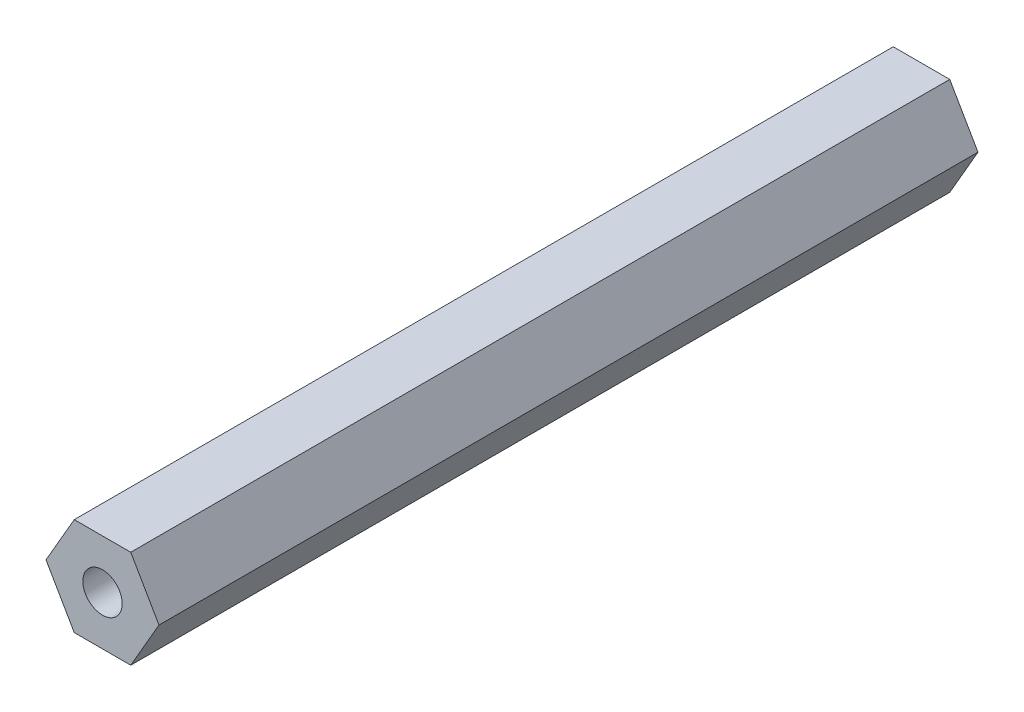
ISO-10303-21;
HEADER;
FILE_DESCRIPTION(('STEP AP214'),'2;1');
FILE_NAME('part.step','',(''),(''),'','','');
FILE_SCHEMA(('AUTOMOTIVE_DESIGN { 1 0 10303 214 1 1 1 1 }'));
ENDSEC;
DATA;
#1=APPLICATION_CONTEXT('core data for automotive mechanical design processes');
#2=APPLICATION_PROTOCOL_DEFINITION('international standard','automotive_design',2000,#1);
#3=PRODUCT_CONTEXT('',#1,'mechanical');
#4=PRODUCT('Part','Part','',(#3));
#5=PRODUCT_RELATED_PRODUCT_CATEGORY('part','',(#4));
#6=PRODUCT_DEFINITION_FORMATION('','',#4);
#7=PRODUCT_DEFINITION_CONTEXT('part definition',#1,'design');
#8=PRODUCT_DEFINITION('design','',#6,#7);
#9=PRODUCT_DEFINITION_SHAPE('','',#8);
#10=(LENGTH_UNIT() NAMED_UNIT(*) SI_UNIT(.MILLI.,.METRE.));
#11=(NAMED_UNIT(*) PLANE_ANGLE_UNIT() SI_UNIT($,.RADIAN.));
#12=(NAMED_UNIT(*) SI_UNIT($,.STERADIAN.) SOLID_ANGLE_UNIT());
#13=UNCERTAINTY_MEASURE_WITH_UNIT(LENGTH_MEASURE(1.E-05),#10,'distance_accuracy_value','');
#14=(GEOMETRIC_REPRESENTATION_CONTEXT(3) GLOBAL_UNCERTAINTY_ASSIGNED_CONTEXT((#13)) GLOBAL_UNIT_ASSIGNED_CONTEXT((#10,
#11,#12)) REPRESENTATION_CONTEXT('',''));
#15=CARTESIAN_POINT('',(0.,0.,0.));
#16=DIRECTION('',(0.,0.,1.));
#17=DIRECTION('',(1.,0.,0.));
#18=AXIS2_PLACEMENT_3D('',#15,#16,#17);
#19=CARTESIAN_POINT('',(-3.66617420935413,-6.35000000000001,106.299));
#20=DIRECTION('',(0.,1.,0.));
#21=DIRECTION('',(0.,0.,1.));
#22=AXIS2_PLACEMENT_3D('',#19,#20,#21);
#23=PLANE('',#22);
#24=DIRECTION('',(1.,0.,0.));
#25=VECTOR('',#24,1.);
#26=CARTESIAN_POINT('',(-3.66617420935413,-6.35000000000001,0.));
#27=LINE('',#26,#25);
#28=CARTESIAN_POINT('',(-3.66617420935413,-6.35000000000001,0.));
#29=VERTEX_POINT('',#28);
#30=CARTESIAN_POINT('',(3.66617420935413,-6.35000000000001,0.));
#31=VERTEX_POINT('',#30);
#32=EDGE_CURVE('E120',#29,#31,#27,.T.);
#33=ORIENTED_EDGE('',*,*,#32,.T.);
#34=DIRECTION('',(0.,0.,-1.));
#35=VECTOR('',#34,1.);
#36=CARTESIAN_POINT('',(3.66617420935413,-6.35000000000001,106.299));
#37=LINE('',#36,#35);
#38=CARTESIAN_POINT('',(3.66617420935413,-6.35000000000001,106.299));
#39=VERTEX_POINT('',#38);
#40=EDGE_CURVE('E11',#39,#31,#37,.T.);
#41=ORIENTED_EDGE('',*,*,#40,.F.);
#42=DIRECTION('',(1.,0.,0.));
#43=VECTOR('',#42,1.);
#44=CARTESIAN_POINT('',(-3.66617420935413,-6.35000000000001,106.299));
#45=LINE('',#44,#43);
#46=CARTESIAN_POINT('',(-3.66617420935413,-6.35000000000001,106.299));
#47=VERTEX_POINT('',#46);
#48=EDGE_CURVE('E131',#47,#39,#45,.T.);
#49=ORIENTED_EDGE('',*,*,#48,.F.);
#50=DIRECTION('',(0.,0.,-1.));
#51=VECTOR('',#50,1.);
#52=CARTESIAN_POINT('',(-3.66617420935413,-6.35000000000001,106.299));
#53=LINE('',#52,#51);
#54=EDGE_CURVE('E116',#47,#29,#53,.T.);
#55=ORIENTED_EDGE('',*,*,#54,.T.);
#56=EDGE_LOOP('',(#33,#41,#49,#55));
#57=FACE_BOUND('',#56,.T.);
#58=ADVANCED_FACE('F36',(#57),#23,.F.);
#59=CARTESIAN_POINT('',(3.66617420935413,-6.35000000000001,106.299));
#60=DIRECTION('',(-0.866025403784439,0.5,0.));
#61=DIRECTION('',(-0.5,-0.866025403784439,0.));
#62=AXIS2_PLACEMENT_3D('',#59,#60,#61);
#63=PLANE('',#62);
#64=DIRECTION('',(0.5,0.866025403784439,0.));
#65=VECTOR('',#64,1.);
#66=CARTESIAN_POINT('',(3.66617420935413,-6.35000000000001,0.));
#67=LINE('',#66,#65);
#68=CARTESIAN_POINT('',(7.33234841870825,0.,0.));
#69=VERTEX_POINT('',#68);
#70=EDGE_CURVE('E123',#31,#69,#67,.T.);
#71=ORIENTED_EDGE('',*,*,#70,.T.);
#72=DIRECTION('',(0.,0.,-1.));
#73=VECTOR('',#72,1.);
#74=CARTESIAN_POINT('',(7.33234841870825,0.,106.299));
#75=LINE('',#74,#73);
#76=CARTESIAN_POINT('',(7.33234841870825,0.,106.299));
#77=VERTEX_POINT('',#76);
#78=EDGE_CURVE('E44',#77,#69,#75,.T.);
#79=ORIENTED_EDGE('',*,*,#78,.F.);
#80=DIRECTION('',(0.5,0.866025403784439,0.));
#81=VECTOR('',#80,1.);
#82=CARTESIAN_POINT('',(3.66617420935413,-6.35000000000001,106.299));
#83=LINE('',#82,#81);
#84=EDGE_CURVE('E89',#39,#77,#83,.T.);
#85=ORIENTED_EDGE('',*,*,#84,.F.);
#86=ORIENTED_EDGE('',*,*,#40,.T.);
#87=EDGE_LOOP('',(#71,#79,#85,#86));
#88=FACE_BOUND('',#87,.T.);
#89=ADVANCED_FACE('F156',(#88),#63,.F.);
#90=CARTESIAN_POINT('',(7.33234841870825,0.,106.299));
#91=DIRECTION('',(-0.866025403784439,-0.5,0.));
#92=DIRECTION('',(0.5,-0.866025403784439,0.));
#93=AXIS2_PLACEMENT_3D('',#90,#91,#92);
#94=PLANE('',#93);
#95=DIRECTION('',(-0.5,0.866025403784438,0.));
#96=VECTOR('',#95,1.);
#97=CARTESIAN_POINT('',(7.33234841870825,0.,0.));
#98=LINE('',#97,#96);
#99=CARTESIAN_POINT('',(3.66617420935412,6.35000000000001,0.));
#100=VERTEX_POINT('',#99);
#101=EDGE_CURVE('E126',#69,#100,#98,.T.);
#102=ORIENTED_EDGE('',*,*,#101,.T.);
#103=DIRECTION('',(0.,0.,-1.));
#104=VECTOR('',#103,1.);
#105=CARTESIAN_POINT('',(3.66617420935412,6.35000000000001,106.299));
#106=LINE('',#105,#104);
#107=CARTESIAN_POINT('',(3.66617420935412,6.35000000000001,106.299));
#108=VERTEX_POINT('',#107);
#109=EDGE_CURVE('E111',#108,#100,#106,.T.);
#110=ORIENTED_EDGE('',*,*,#109,.F.);
#111=DIRECTION('',(-0.5,0.866025403784438,0.));
#112=VECTOR('',#111,1.);
#113=CARTESIAN_POINT('',(7.33234841870825,0.,106.299));
#114=LINE('',#113,#112);
#115=EDGE_CURVE('E102',#77,#108,#114,.T.);
#116=ORIENTED_EDGE('',*,*,#115,.F.);
#117=ORIENTED_EDGE('',*,*,#78,.T.);
#118=EDGE_LOOP('',(#102,#110,#116,#117));
#119=FACE_BOUND('',#118,.T.);
#120=ADVANCED_FACE('F137',(#119),#94,.F.);
#121=CARTESIAN_POINT('',(3.66617420935412,6.35000000000001,106.299));
#122=DIRECTION('',(0.,-1.,0.));
#123=DIRECTION('',(1.,0.,0.));
#124=AXIS2_PLACEMENT_3D('',#121,#122,#123);
#125=PLANE('',#124);
#126=DIRECTION('',(-1.,0.,0.));
#127=VECTOR('',#126,1.);
#128=CARTESIAN_POINT('',(3.66617420935412,6.35000000000001,0.));
#129=LINE('',#128,#127);
#130=CARTESIAN_POINT('',(-3.66617420935413,6.35000000000001,0.));
#131=VERTEX_POINT('',#130);
#132=EDGE_CURVE('E110',#100,#131,#129,.T.);
#133=ORIENTED_EDGE('',*,*,#132,.T.);
#134=DIRECTION('',(0.,0.,-1.));
#135=VECTOR('',#134,1.);
#136=CARTESIAN_POINT('',(-3.66617420935413,6.35000000000001,106.299));
#137=LINE('',#136,#135);
#138=CARTESIAN_POINT('',(-3.66617420935413,6.35000000000001,106.299));
#139=VERTEX_POINT('',#138);
#140=EDGE_CURVE('E107',#139,#131,#137,.T.);
#141=ORIENTED_EDGE('',*,*,#140,.F.);
#142=DIRECTION('',(-1.,0.,0.));
#143=VECTOR('',#142,1.);
#144=CARTESIAN_POINT('',(3.66617420935412,6.35000000000001,106.299));
#145=LINE('',#144,#143);
#146=EDGE_CURVE('E96',#108,#139,#145,.T.);
#147=ORIENTED_EDGE('',*,*,#146,.F.);
#148=ORIENTED_EDGE('',*,*,#109,.T.);
#149=EDGE_LOOP('',(#133,#141,#147,#148));
#150=FACE_BOUND('',#149,.T.);
#151=ADVANCED_FACE('F108',(#150),#125,.F.);
#152=CARTESIAN_POINT('',(-3.66617420935413,6.35000000000001,106.299));
#153=DIRECTION('',(0.866025403784439,-0.499999999999999,0.));
#154=DIRECTION('',(0.499999999999999,0.866025403784439,0.));
#155=AXIS2_PLACEMENT_3D('',#152,#153,#154);
#156=PLANE('',#155);
#157=DIRECTION('',(-0.5,-0.866025403784439,0.));
#158=VECTOR('',#157,1.);
#159=CARTESIAN_POINT('',(-3.66617420935413,6.35000000000001,0.));
#160=LINE('',#159,#158);
#161=CARTESIAN_POINT('',(-7.33234841870825,0.,0.));
#162=VERTEX_POINT('',#161);
#163=EDGE_CURVE('E75',#131,#162,#160,.T.);
#164=ORIENTED_EDGE('',*,*,#163,.T.);
#165=DIRECTION('',(0.,0.,-1.));
#166=VECTOR('',#165,1.);
#167=CARTESIAN_POINT('',(-7.33234841870825,0.,106.299));
#168=LINE('',#167,#166);
#169=CARTESIAN_POINT('',(-7.33234841870825,0.,106.299));
#170=VERTEX_POINT('',#169);
#171=EDGE_CURVE('E112',#170,#162,#168,.T.);
#172=ORIENTED_EDGE('',*,*,#171,.F.);
#173=DIRECTION('',(-0.5,-0.866025403784439,0.));
#174=VECTOR('',#173,1.);
#175=CARTESIAN_POINT('',(-3.66617420935413,6.35000000000001,106.299));
#176=LINE('',#175,#174);
#177=EDGE_CURVE('E100',#139,#170,#176,.T.);
#178=ORIENTED_EDGE('',*,*,#177,.F.);
#179=ORIENTED_EDGE('',*,*,#140,.T.);
#180=EDGE_LOOP('',(#164,#172,#178,#179));
#181=FACE_BOUND('',#180,.T.);
#182=ADVANCED_FACE('F114',(#181),#156,.F.);
#183=CARTESIAN_POINT('',(-7.33234841870825,0.,106.299));
#184=DIRECTION('',(0.866025403784438,0.5,0.));
#185=DIRECTION('',(-0.5,0.866025403784439,0.));
#186=AXIS2_PLACEMENT_3D('',#183,#184,#185);
#187=PLANE('',#186);
#188=DIRECTION('',(0.5,-0.866025403784439,0.));
#189=VECTOR('',#188,1.);
#190=CARTESIAN_POINT('',(-7.33234841870825,0.,0.));
#191=LINE('',#190,#189);
#192=EDGE_CURVE('E81',#162,#29,#191,.T.);
#193=ORIENTED_EDGE('',*,*,#192,.T.);
#194=ORIENTED_EDGE('',*,*,#54,.F.);
#195=DIRECTION('',(0.5,-0.866025403784439,0.));
#196=VECTOR('',#195,1.);
#197=CARTESIAN_POINT('',(-7.33234841870825,0.,106.299));
#198=LINE('',#197,#196);
#199=EDGE_CURVE('E52',#170,#47,#198,.T.);
#200=ORIENTED_EDGE('',*,*,#199,.F.);
#201=ORIENTED_EDGE('',*,*,#171,.T.);
#202=EDGE_LOOP('',(#193,#194,#200,#201));
#203=FACE_BOUND('',#202,.T.);
#204=ADVANCED_FACE('F144',(#203),#187,.F.);
#205=CARTESIAN_POINT('',(0.,0.,106.299));
#206=DIRECTION('',(0.,0.,1.));
#207=DIRECTION('',(1.,0.,0.));
#208=AXIS2_PLACEMENT_3D('',#205,#206,#207);
#209=PLANE('',#208);
#210=CARTESIAN_POINT('',(0.,0.,106.299));
#211=DIRECTION('',(0.,0.,-1.));
#212=DIRECTION('',(-1.,0.,0.));
#213=AXIS2_PLACEMENT_3D('',#210,#211,#212);
#214=CIRCLE('',#213,2.55269999999997);
#215=CARTESIAN_POINT('',(-2.55269999999997,0.,106.299));
#216=VERTEX_POINT('',#215);
#217=EDGE_CURVE('E124',#216,#216,#214,.T.);
#218=ORIENTED_EDGE('',*,*,#217,.T.);
#219=EDGE_LOOP('',(#218));
#220=FACE_BOUND('',#219,.T.);
#221=ORIENTED_EDGE('',*,*,#48,.T.);
#222=ORIENTED_EDGE('',*,*,#84,.T.);
#223=ORIENTED_EDGE('',*,*,#115,.T.);
#224=ORIENTED_EDGE('',*,*,#146,.T.);
#225=ORIENTED_EDGE('',*,*,#177,.T.);
#226=ORIENTED_EDGE('',*,*,#199,.T.);
#227=EDGE_LOOP('',(#221,#222,#223,#224,#225,#226));
#228=FACE_BOUND('',#227,.T.);
#229=ADVANCED_FACE('F98',(#220,#228),#209,.T.);
#230=CARTESIAN_POINT('',(0.,0.,0.));
#231=DIRECTION('',(0.,0.,1.));
#232=DIRECTION('',(1.,0.,0.));
#233=AXIS2_PLACEMENT_3D('',#230,#231,#232);
#234=PLANE('',#233);
#235=CARTESIAN_POINT('',(0.,0.,0.));
#236=DIRECTION('',(0.,0.,-1.));
#237=DIRECTION('',(-1.,0.,0.));
#238=AXIS2_PLACEMENT_3D('',#235,#236,#237);
#239=CIRCLE('',#238,2.5527);
#240=CARTESIAN_POINT('',(-2.5527,0.,0.));
#241=VERTEX_POINT('',#240);
#242=EDGE_CURVE('E236',#241,#241,#239,.T.);
#243=ORIENTED_EDGE('',*,*,#242,.F.);
#244=EDGE_LOOP('',(#243));
#245=FACE_BOUND('',#244,.T.);
#246=ORIENTED_EDGE('',*,*,#32,.F.);
#247=ORIENTED_EDGE('',*,*,#192,.F.);
#248=ORIENTED_EDGE('',*,*,#163,.F.);
#249=ORIENTED_EDGE('',*,*,#132,.F.);
#250=ORIENTED_EDGE('',*,*,#101,.F.);
#251=ORIENTED_EDGE('',*,*,#70,.F.);
#252=EDGE_LOOP('',(#246,#247,#248,#249,#250,#251));
#253=FACE_BOUND('',#252,.T.);
#254=ADVANCED_FACE('F140',(#245,#253),#234,.F.);
#255=CARTESIAN_POINT('',(0.,0.,0.));
#256=DIRECTION('',(0.,0.,-1.));
#257=DIRECTION('',(-1.,0.,0.));
#258=AXIS2_PLACEMENT_3D('',#255,#256,#257);
#259=CYLINDRICAL_SURFACE('',#258,2.55269999999999);
#260=ORIENTED_EDGE('',*,*,#217,.F.);
#261=EDGE_LOOP('',(#260));
#262=FACE_BOUND('',#261,.T.);
#263=ORIENTED_EDGE('',*,*,#242,.T.);
#264=EDGE_LOOP('',(#263));
#265=FACE_BOUND('',#264,.T.);
#266=ADVANCED_FACE('F190',(#262,#265),#259,.F.);
#267=CLOSED_SHELL('',(#58,#89,#120,#151,#182,#204,#229,#254,#266));
#268=MANIFOLD_SOLID_BREP('B2',#267);
#269=ADVANCED_BREP_SHAPE_REPRESENTATION('',(#18,#268),#14);
#270=SHAPE_DEFINITION_REPRESENTATION(#9,#269);
ENDSEC;
END-ISO-10303-21;
